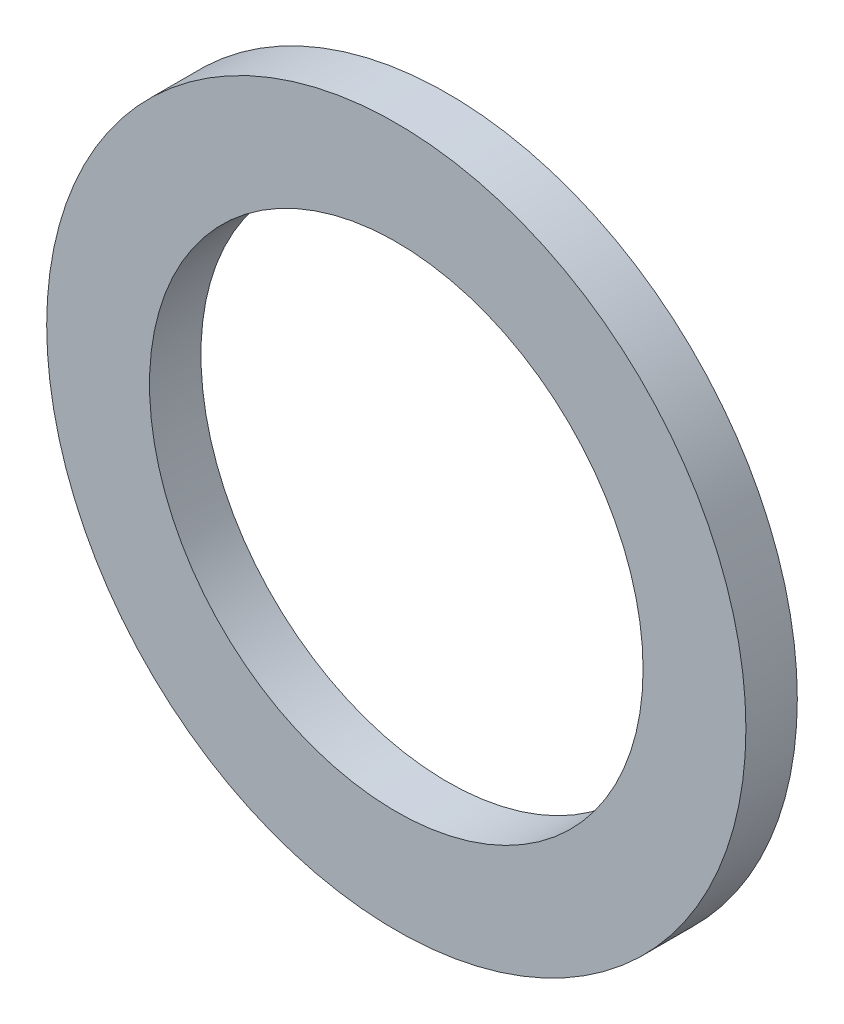
ISO-10303-21;
HEADER;
FILE_DESCRIPTION(('STEP AP214'),'2;1');
FILE_NAME('part.step','',(''),(''),'','','');
FILE_SCHEMA(('AUTOMOTIVE_DESIGN { 1 0 10303 214 1 1 1 1 }'));
ENDSEC;
DATA;
#1=APPLICATION_CONTEXT('core data for automotive mechanical design processes');
#2=APPLICATION_PROTOCOL_DEFINITION('international standard','automotive_design',2000,#1);
#3=PRODUCT_CONTEXT('',#1,'mechanical');
#4=PRODUCT('Part','Part','',(#3));
#5=PRODUCT_RELATED_PRODUCT_CATEGORY('part','',(#4));
#6=PRODUCT_DEFINITION_FORMATION('','',#4);
#7=PRODUCT_DEFINITION_CONTEXT('part definition',#1,'design');
#8=PRODUCT_DEFINITION('design','',#6,#7);
#9=PRODUCT_DEFINITION_SHAPE('','',#8);
#10=(LENGTH_UNIT() NAMED_UNIT(*) SI_UNIT(.MILLI.,.METRE.));
#11=(NAMED_UNIT(*) PLANE_ANGLE_UNIT() SI_UNIT($,.RADIAN.));
#12=(NAMED_UNIT(*) SI_UNIT($,.STERADIAN.) SOLID_ANGLE_UNIT());
#13=UNCERTAINTY_MEASURE_WITH_UNIT(LENGTH_MEASURE(1.E-05),#10,'distance_accuracy_value','');
#14=(GEOMETRIC_REPRESENTATION_CONTEXT(3) GLOBAL_UNCERTAINTY_ASSIGNED_CONTEXT((#13)) GLOBAL_UNIT_ASSIGNED_CONTEXT((#10,
#11,#12)) REPRESENTATION_CONTEXT('',''));
#15=CARTESIAN_POINT('',(0.,0.,0.));
#16=DIRECTION('',(0.,0.,1.));
#17=DIRECTION('',(1.,0.,0.));
#18=AXIS2_PLACEMENT_3D('',#15,#16,#17);
#19=CARTESIAN_POINT('',(0.,0.,3.175));
#20=DIRECTION('',(0.,0.,1.));
#21=DIRECTION('',(1.,0.,0.));
#22=AXIS2_PLACEMENT_3D('',#19,#20,#21);
#23=PLANE('',#22);
#24=CARTESIAN_POINT('',(0.,0.,3.175));
#25=DIRECTION('',(0.,0.,1.));
#26=DIRECTION('',(1.,0.,0.));
#27=AXIS2_PLACEMENT_3D('',#24,#25,#26);
#28=CIRCLE('',#27,21.59);
#29=CARTESIAN_POINT('',(21.59,0.,3.175));
#30=VERTEX_POINT('',#29);
#31=EDGE_CURVE('E10',#30,#30,#28,.T.);
#32=ORIENTED_EDGE('',*,*,#31,.T.);
#33=EDGE_LOOP('',(#32));
#34=FACE_BOUND('',#33,.T.);
#35=CARTESIAN_POINT('',(0.,0.,3.175));
#36=DIRECTION('',(0.,0.,1.));
#37=DIRECTION('',(1.,0.,0.));
#38=AXIS2_PLACEMENT_3D('',#35,#36,#37);
#39=CIRCLE('',#38,15.24);
#40=CARTESIAN_POINT('',(15.24,0.,3.175));
#41=VERTEX_POINT('',#40);
#42=EDGE_CURVE('E42',#41,#41,#39,.T.);
#43=ORIENTED_EDGE('',*,*,#42,.F.);
#44=EDGE_LOOP('',(#43));
#45=FACE_BOUND('',#44,.T.);
#46=ADVANCED_FACE('F31',(#34,#45),#23,.T.);
#47=CARTESIAN_POINT('',(0.,0.,0.));
#48=DIRECTION('',(0.,0.,1.));
#49=DIRECTION('',(1.,0.,0.));
#50=AXIS2_PLACEMENT_3D('',#47,#48,#49);
#51=PLANE('',#50);
#52=CARTESIAN_POINT('',(0.,0.,0.));
#53=DIRECTION('',(0.,0.,1.));
#54=DIRECTION('',(1.,0.,0.));
#55=AXIS2_PLACEMENT_3D('',#52,#53,#54);
#56=CIRCLE('',#55,21.59);
#57=CARTESIAN_POINT('',(21.59,0.,0.));
#58=VERTEX_POINT('',#57);
#59=EDGE_CURVE('E35',#58,#58,#56,.T.);
#60=ORIENTED_EDGE('',*,*,#59,.F.);
#61=EDGE_LOOP('',(#60));
#62=FACE_BOUND('',#61,.T.);
#63=CARTESIAN_POINT('',(0.,0.,0.));
#64=DIRECTION('',(0.,0.,1.));
#65=DIRECTION('',(1.,0.,0.));
#66=AXIS2_PLACEMENT_3D('',#63,#64,#65);
#67=CIRCLE('',#66,15.24);
#68=CARTESIAN_POINT('',(15.24,0.,0.));
#69=VERTEX_POINT('',#68);
#70=EDGE_CURVE('E44',#69,#69,#67,.T.);
#71=ORIENTED_EDGE('',*,*,#70,.T.);
#72=EDGE_LOOP('',(#71));
#73=FACE_BOUND('',#72,.T.);
#74=ADVANCED_FACE('F54',(#62,#73),#51,.F.);
#75=CARTESIAN_POINT('',(0.,0.,3.175));
#76=DIRECTION('',(0.,0.,-1.));
#77=DIRECTION('',(-1.,0.,0.));
#78=AXIS2_PLACEMENT_3D('',#75,#76,#77);
#79=CYLINDRICAL_SURFACE('',#78,21.59);
#80=ORIENTED_EDGE('',*,*,#31,.F.);
#81=EDGE_LOOP('',(#80));
#82=FACE_BOUND('',#81,.T.);
#83=ORIENTED_EDGE('',*,*,#59,.T.);
#84=EDGE_LOOP('',(#83));
#85=FACE_BOUND('',#84,.T.);
#86=ADVANCED_FACE('F33',(#82,#85),#79,.T.);
#87=CARTESIAN_POINT('',(0.,0.,3.175));
#88=DIRECTION('',(0.,0.,-1.));
#89=DIRECTION('',(-1.,0.,0.));
#90=AXIS2_PLACEMENT_3D('',#87,#88,#89);
#91=CYLINDRICAL_SURFACE('',#90,15.24);
#92=ORIENTED_EDGE('',*,*,#42,.T.);
#93=EDGE_LOOP('',(#92));
#94=FACE_BOUND('',#93,.T.);
#95=ORIENTED_EDGE('',*,*,#70,.F.);
#96=EDGE_LOOP('',(#95));
#97=FACE_BOUND('',#96,.T.);
#98=ADVANCED_FACE('F50',(#94,#97),#91,.F.);
#99=CLOSED_SHELL('',(#46,#74,#86,#98));
#100=MANIFOLD_SOLID_BREP('B2',#99);
#101=ADVANCED_BREP_SHAPE_REPRESENTATION('',(#18,#100),#14);
#102=SHAPE_DEFINITION_REPRESENTATION(#9,#101);
ENDSEC;
END-ISO-10303-21;
